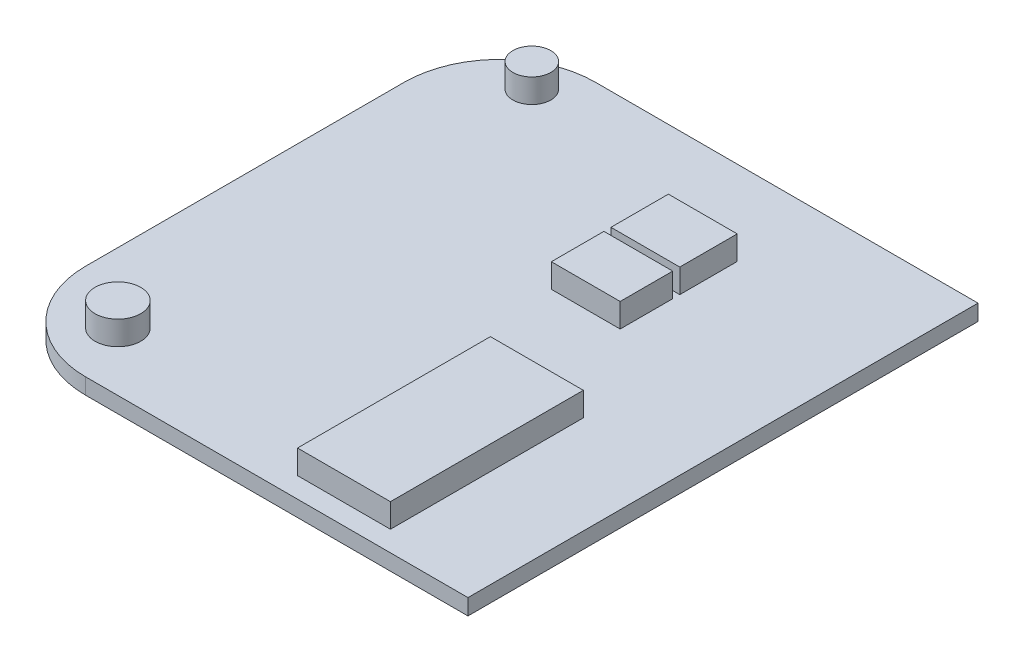
ISO-10303-21;
HEADER;
FILE_DESCRIPTION(('STEP AP214'),'2;1');
FILE_NAME('part.step','',(''),(''),'','','');
FILE_SCHEMA(('AUTOMOTIVE_DESIGN { 1 0 10303 214 1 1 1 1 }'));
ENDSEC;
DATA;
#1=APPLICATION_CONTEXT('core data for automotive mechanical design processes');
#2=APPLICATION_PROTOCOL_DEFINITION('international standard','automotive_design',2000,#1);
#3=PRODUCT_CONTEXT('',#1,'mechanical');
#4=PRODUCT('Part','Part','',(#3));
#5=PRODUCT_RELATED_PRODUCT_CATEGORY('part','',(#4));
#6=PRODUCT_DEFINITION_FORMATION('','',#4);
#7=PRODUCT_DEFINITION_CONTEXT('part definition',#1,'design');
#8=PRODUCT_DEFINITION('design','',#6,#7);
#9=PRODUCT_DEFINITION_SHAPE('','',#8);
#10=(LENGTH_UNIT() NAMED_UNIT(*) SI_UNIT(.MILLI.,.METRE.));
#11=(NAMED_UNIT(*) PLANE_ANGLE_UNIT() SI_UNIT($,.RADIAN.));
#12=(NAMED_UNIT(*) SI_UNIT($,.STERADIAN.) SOLID_ANGLE_UNIT());
#13=UNCERTAINTY_MEASURE_WITH_UNIT(LENGTH_MEASURE(1.E-05),#10,'distance_accuracy_value','');
#14=(GEOMETRIC_REPRESENTATION_CONTEXT(3) GLOBAL_UNCERTAINTY_ASSIGNED_CONTEXT((#13)) GLOBAL_UNIT_ASSIGNED_CONTEXT((#10,
#11,#12)) REPRESENTATION_CONTEXT('',''));
#15=CARTESIAN_POINT('',(0.,0.,0.));
#16=DIRECTION('',(0.,0.,1.));
#17=DIRECTION('',(1.,0.,0.));
#18=AXIS2_PLACEMENT_3D('',#15,#16,#17);
#19=CARTESIAN_POINT('',(-6.99273607748182,1.,10.7360774818402));
#20=DIRECTION('',(0.,1.,0.));
#21=DIRECTION('',(0.,0.,1.));
#22=AXIS2_PLACEMENT_3D('',#19,#20,#21);
#23=PLANE('',#22);
#24=CARTESIAN_POINT('',(-8.61619204420754,1.,-12.8959412146622));
#25=DIRECTION('',(0.,1.,0.));
#26=DIRECTION('',(0.,0.,1.));
#27=AXIS2_PLACEMENT_3D('',#24,#25,#26);
#28=CIRCLE('',#27,1.18982706827328);
#29=CARTESIAN_POINT('',(-8.61619204420754,1.,-11.706114146389));
#30=VERTEX_POINT('',#29);
#31=EDGE_CURVE('E405',#30,#30,#28,.T.);
#32=ORIENTED_EDGE('',*,*,#31,.F.);
#33=EDGE_LOOP('',(#32));
#34=FACE_BOUND('',#33,.T.);
#35=CARTESIAN_POINT('',(-8.61619204420754,1.,13.0762839327888));
#36=DIRECTION('',(0.,1.,0.));
#37=DIRECTION('',(0.,0.,1.));
#38=AXIS2_PLACEMENT_3D('',#35,#36,#37);
#39=CIRCLE('',#38,1.43304396443584);
#40=CARTESIAN_POINT('',(-8.61619204420754,1.,14.5093278972246));
#41=VERTEX_POINT('',#40);
#42=EDGE_CURVE('E404',#41,#41,#39,.T.);
#43=ORIENTED_EDGE('',*,*,#42,.F.);
#44=EDGE_LOOP('',(#43));
#45=FACE_BOUND('',#44,.T.);
#46=DIRECTION('',(0.,0.,-1.));
#47=VECTOR('',#46,1.);
#48=CARTESIAN_POINT('',(17.0072639225182,1.,-15.2639225181598));
#49=LINE('',#48,#47);
#50=CARTESIAN_POINT('',(17.0072639225182,1.,16.7360774818402));
#51=VERTEX_POINT('',#50);
#52=CARTESIAN_POINT('',(17.0072639225182,1.,-15.2639225181598));
#53=VERTEX_POINT('',#52);
#54=EDGE_CURVE('E247',#51,#53,#49,.T.);
#55=ORIENTED_EDGE('',*,*,#54,.T.);
#56=DIRECTION('',(-1.,0.,0.));
#57=VECTOR('',#56,1.);
#58=CARTESIAN_POINT('',(-6.99273607748178,1.,-15.2639225181598));
#59=LINE('',#58,#57);
#60=CARTESIAN_POINT('',(-6.99273607748178,1.,-15.2639225181598));
#61=VERTEX_POINT('',#60);
#62=EDGE_CURVE('E250',#53,#61,#59,.T.);
#63=ORIENTED_EDGE('',*,*,#62,.T.);
#64=CARTESIAN_POINT('',(-6.99273607748182,1.,-9.26392251815981));
#65=DIRECTION('',(0.,1.,0.));
#66=DIRECTION('',(0.,0.,1.));
#67=AXIS2_PLACEMENT_3D('',#64,#65,#66);
#68=CIRCLE('',#67,6.);
#69=CARTESIAN_POINT('',(-12.9927360774818,1.,-9.26392251815977));
#70=VERTEX_POINT('',#69);
#71=EDGE_CURVE('E253',#61,#70,#68,.T.);
#72=ORIENTED_EDGE('',*,*,#71,.T.);
#73=DIRECTION('',(0.,0.,1.));
#74=VECTOR('',#73,1.);
#75=CARTESIAN_POINT('',(-12.9927360774818,1.,-9.26392251815977));
#76=LINE('',#75,#74);
#77=CARTESIAN_POINT('',(-12.9927360774818,1.,10.7360774818401));
#78=VERTEX_POINT('',#77);
#79=EDGE_CURVE('E255',#70,#78,#76,.T.);
#80=ORIENTED_EDGE('',*,*,#79,.T.);
#81=CARTESIAN_POINT('',(-6.99273607748182,1.,10.7360774818402));
#82=DIRECTION('',(0.,1.,0.));
#83=DIRECTION('',(0.,0.,1.));
#84=AXIS2_PLACEMENT_3D('',#81,#82,#83);
#85=CIRCLE('',#84,6.);
#86=CARTESIAN_POINT('',(-6.99273607748178,1.,16.7360774818402));
#87=VERTEX_POINT('',#86);
#88=EDGE_CURVE('E257',#78,#87,#85,.T.);
#89=ORIENTED_EDGE('',*,*,#88,.T.);
#90=DIRECTION('',(1.,0.,0.));
#91=VECTOR('',#90,1.);
#92=CARTESIAN_POINT('',(-6.99273607748178,1.,16.7360774818402));
#93=LINE('',#92,#91);
#94=EDGE_CURVE('E259',#87,#51,#93,.T.);
#95=ORIENTED_EDGE('',*,*,#94,.T.);
#96=EDGE_LOOP('',(#55,#63,#72,#80,#89,#95));
#97=FACE_BOUND('',#96,.T.);
#98=DIRECTION('',(1.,0.,0.));
#99=VECTOR('',#98,1.);
#100=CARTESIAN_POINT('',(2.874137929403,1.,-6.36888986870597));
#101=LINE('',#100,#99);
#102=CARTESIAN_POINT('',(2.874137929403,1.,-6.36888986870597));
#103=VERTEX_POINT('',#102);
#104=CARTESIAN_POINT('',(7.19151043428033,1.,-6.36888986870597));
#105=VERTEX_POINT('',#104);
#106=EDGE_CURVE('E231',#103,#105,#101,.T.);
#107=ORIENTED_EDGE('',*,*,#106,.F.);
#108=DIRECTION('',(0.,0.,1.));
#109=VECTOR('',#108,1.);
#110=CARTESIAN_POINT('',(2.874137929403,1.,-9.97236613261934));
#111=LINE('',#110,#109);
#112=CARTESIAN_POINT('',(2.874137929403,1.,-9.97236613261934));
#113=VERTEX_POINT('',#112);
#114=EDGE_CURVE('E217',#113,#103,#111,.T.);
#115=ORIENTED_EDGE('',*,*,#114,.F.);
#116=DIRECTION('',(-1.,0.,0.));
#117=VECTOR('',#116,1.);
#118=CARTESIAN_POINT('',(2.874137929403,1.,-9.97236613261934));
#119=LINE('',#118,#117);
#120=CARTESIAN_POINT('',(7.19151043428033,1.,-9.97236613261934));
#121=VERTEX_POINT('',#120);
#122=EDGE_CURVE('E222',#121,#113,#119,.T.);
#123=ORIENTED_EDGE('',*,*,#122,.F.);
#124=DIRECTION('',(0.,0.,-1.));
#125=VECTOR('',#124,1.);
#126=CARTESIAN_POINT('',(7.19151043428033,1.,-9.97236613261934));
#127=LINE('',#126,#125);
#128=EDGE_CURVE('E233',#105,#121,#127,.T.);
#129=ORIENTED_EDGE('',*,*,#128,.F.);
#130=EDGE_LOOP('',(#107,#115,#123,#129));
#131=FACE_BOUND('',#130,.T.);
#132=DIRECTION('',(1.,0.,0.));
#133=VECTOR('',#132,1.);
#134=CARTESIAN_POINT('',(2.874137929403,1.,-2.62943336841852));
#135=LINE('',#134,#133);
#136=CARTESIAN_POINT('',(2.874137929403,1.,-2.62943336841852));
#137=VERTEX_POINT('',#136);
#138=CARTESIAN_POINT('',(7.19151043428033,1.,-2.62943336841852));
#139=VERTEX_POINT('',#138);
#140=EDGE_CURVE('E189',#137,#139,#135,.T.);
#141=ORIENTED_EDGE('',*,*,#140,.F.);
#142=DIRECTION('',(0.,0.,1.));
#143=VECTOR('',#142,1.);
#144=CARTESIAN_POINT('',(2.874137929403,1.,-5.92695410049018));
#145=LINE('',#144,#143);
#146=CARTESIAN_POINT('',(2.874137929403,1.,-5.92695410049018));
#147=VERTEX_POINT('',#146);
#148=EDGE_CURVE('E186',#147,#137,#145,.T.);
#149=ORIENTED_EDGE('',*,*,#148,.F.);
#150=DIRECTION('',(-1.,0.,0.));
#151=VECTOR('',#150,1.);
#152=CARTESIAN_POINT('',(2.874137929403,1.,-5.92695410049018));
#153=LINE('',#152,#151);
#154=CARTESIAN_POINT('',(7.19151043428033,1.,-5.92695410049018));
#155=VERTEX_POINT('',#154);
#156=EDGE_CURVE('E198',#155,#147,#153,.T.);
#157=ORIENTED_EDGE('',*,*,#156,.F.);
#158=DIRECTION('',(0.,0.,-1.));
#159=VECTOR('',#158,1.);
#160=CARTESIAN_POINT('',(7.19151043428033,1.,-5.92695410049018));
#161=LINE('',#160,#159);
#162=EDGE_CURVE('E206',#139,#155,#161,.T.);
#163=ORIENTED_EDGE('',*,*,#162,.F.);
#164=EDGE_LOOP('',(#141,#149,#157,#163));
#165=FACE_BOUND('',#164,.T.);
#166=DIRECTION('',(1.,0.,0.));
#167=VECTOR('',#166,1.);
#168=CARTESIAN_POINT('',(5.03282418184167,1.,15.4559380693353));
#169=LINE('',#168,#167);
#170=CARTESIAN_POINT('',(5.03282418184167,1.,15.4559380693353));
#171=VERTEX_POINT('',#170);
#172=CARTESIAN_POINT('',(10.8629768163807,1.,15.4559380693353));
#173=VERTEX_POINT('',#172);
#174=EDGE_CURVE('E419',#171,#173,#169,.T.);
#175=ORIENTED_EDGE('',*,*,#174,.F.);
#176=DIRECTION('',(0.,0.,1.));
#177=VECTOR('',#176,1.);
#178=CARTESIAN_POINT('',(5.03282418184167,1.,3.3536970320414));
#179=LINE('',#178,#177);
#180=CARTESIAN_POINT('',(5.03282418184167,1.,3.3536970320414));
#181=VERTEX_POINT('',#180);
#182=EDGE_CURVE('E184',#181,#171,#179,.T.);
#183=ORIENTED_EDGE('',*,*,#182,.F.);
#184=DIRECTION('',(-1.,0.,0.));
#185=VECTOR('',#184,1.);
#186=CARTESIAN_POINT('',(5.03282418184167,1.,3.3536970320414));
#187=LINE('',#186,#185);
#188=CARTESIAN_POINT('',(10.8629768163807,1.,3.3536970320414));
#189=VERTEX_POINT('',#188);
#190=EDGE_CURVE('E180',#189,#181,#187,.T.);
#191=ORIENTED_EDGE('',*,*,#190,.F.);
#192=DIRECTION('',(0.,0.,-1.));
#193=VECTOR('',#192,1.);
#194=CARTESIAN_POINT('',(10.8629768163807,1.,3.3536970320414));
#195=LINE('',#194,#193);
#196=EDGE_CURVE('E421',#173,#189,#195,.T.);
#197=ORIENTED_EDGE('',*,*,#196,.F.);
#198=EDGE_LOOP('',(#175,#183,#191,#197));
#199=FACE_BOUND('',#198,.T.);
#200=ADVANCED_FACE('F35',(#34,#45,#97,#131,#165,#199),#23,.T.);
#201=CARTESIAN_POINT('',(17.0072639225182,1.,-15.2639225181598));
#202=DIRECTION('',(-1.,0.,0.));
#203=DIRECTION('',(0.,0.,1.));
#204=AXIS2_PLACEMENT_3D('',#201,#202,#203);
#205=PLANE('',#204);
#206=DIRECTION('',(0.,0.,-1.));
#207=VECTOR('',#206,1.);
#208=CARTESIAN_POINT('',(17.0072639225182,0.,-15.2639225181598));
#209=LINE('',#208,#207);
#210=CARTESIAN_POINT('',(17.0072639225182,0.,16.7360774818402));
#211=VERTEX_POINT('',#210);
#212=CARTESIAN_POINT('',(17.0072639225182,0.,-15.2639225181598));
#213=VERTEX_POINT('',#212);
#214=EDGE_CURVE('E246',#211,#213,#209,.T.);
#215=ORIENTED_EDGE('',*,*,#214,.T.);
#216=DIRECTION('',(0.,-1.,0.));
#217=VECTOR('',#216,1.);
#218=CARTESIAN_POINT('',(17.0072639225182,1.,-15.2639225181598));
#219=LINE('',#218,#217);
#220=EDGE_CURVE('E11',#53,#213,#219,.T.);
#221=ORIENTED_EDGE('',*,*,#220,.F.);
#222=ORIENTED_EDGE('',*,*,#54,.F.);
#223=DIRECTION('',(0.,-1.,0.));
#224=VECTOR('',#223,1.);
#225=CARTESIAN_POINT('',(17.0072639225182,1.,16.7360774818402));
#226=LINE('',#225,#224);
#227=EDGE_CURVE('E261',#51,#211,#226,.T.);
#228=ORIENTED_EDGE('',*,*,#227,.T.);
#229=EDGE_LOOP('',(#215,#221,#222,#228));
#230=FACE_BOUND('',#229,.T.);
#231=ADVANCED_FACE('F37',(#230),#205,.F.);
#232=CARTESIAN_POINT('',(-6.99273607748178,1.,-15.2639225181598));
#233=DIRECTION('',(0.,0.,1.));
#234=DIRECTION('',(1.,0.,0.));
#235=AXIS2_PLACEMENT_3D('',#232,#233,#234);
#236=PLANE('',#235);
#237=DIRECTION('',(-1.,0.,0.));
#238=VECTOR('',#237,1.);
#239=CARTESIAN_POINT('',(-6.99273607748178,0.,-15.2639225181598));
#240=LINE('',#239,#238);
#241=CARTESIAN_POINT('',(-6.99273607748178,0.,-15.2639225181598));
#242=VERTEX_POINT('',#241);
#243=EDGE_CURVE('E264',#213,#242,#240,.T.);
#244=ORIENTED_EDGE('',*,*,#243,.T.);
#245=DIRECTION('',(0.,-1.,0.));
#246=VECTOR('',#245,1.);
#247=CARTESIAN_POINT('',(-6.99273607748178,1.,-15.2639225181598));
#248=LINE('',#247,#246);
#249=EDGE_CURVE('E43',#61,#242,#248,.T.);
#250=ORIENTED_EDGE('',*,*,#249,.F.);
#251=ORIENTED_EDGE('',*,*,#62,.F.);
#252=ORIENTED_EDGE('',*,*,#220,.T.);
#253=EDGE_LOOP('',(#244,#250,#251,#252));
#254=FACE_BOUND('',#253,.T.);
#255=ADVANCED_FACE('F311',(#254),#236,.F.);
#256=CARTESIAN_POINT('',(-6.99273607748182,1.,-9.26392251815981));
#257=DIRECTION('',(0.,-1.,0.));
#258=DIRECTION('',(0.,0.,-1.));
#259=AXIS2_PLACEMENT_3D('',#256,#257,#258);
#260=CYLINDRICAL_SURFACE('',#259,6.);
#261=CARTESIAN_POINT('',(-6.99273607748182,0.,-9.26392251815981));
#262=DIRECTION('',(0.,1.,0.));
#263=DIRECTION('',(0.,0.,1.));
#264=AXIS2_PLACEMENT_3D('',#261,#262,#263);
#265=CIRCLE('',#264,6.);
#266=CARTESIAN_POINT('',(-12.9927360774818,0.,-9.26392251815977));
#267=VERTEX_POINT('',#266);
#268=EDGE_CURVE('E266',#242,#267,#265,.T.);
#269=ORIENTED_EDGE('',*,*,#268,.T.);
#270=DIRECTION('',(0.,-1.,0.));
#271=VECTOR('',#270,1.);
#272=CARTESIAN_POINT('',(-12.9927360774818,1.,-9.26392251815977));
#273=LINE('',#272,#271);
#274=EDGE_CURVE('E281',#70,#267,#273,.T.);
#275=ORIENTED_EDGE('',*,*,#274,.F.);
#276=ORIENTED_EDGE('',*,*,#71,.F.);
#277=ORIENTED_EDGE('',*,*,#249,.T.);
#278=EDGE_LOOP('',(#269,#275,#276,#277));
#279=FACE_BOUND('',#278,.T.);
#280=ADVANCED_FACE('F288',(#279),#260,.T.);
#281=CARTESIAN_POINT('',(-12.9927360774818,1.,-9.26392251815977));
#282=DIRECTION('',(1.,0.,0.));
#283=DIRECTION('',(0.,0.,-1.));
#284=AXIS2_PLACEMENT_3D('',#281,#282,#283);
#285=PLANE('',#284);
#286=DIRECTION('',(0.,0.,1.));
#287=VECTOR('',#286,1.);
#288=CARTESIAN_POINT('',(-12.9927360774818,0.,-9.26392251815977));
#289=LINE('',#288,#287);
#290=CARTESIAN_POINT('',(-12.9927360774818,0.,10.7360774818401));
#291=VERTEX_POINT('',#290);
#292=EDGE_CURVE('E268',#267,#291,#289,.T.);
#293=ORIENTED_EDGE('',*,*,#292,.T.);
#294=DIRECTION('',(0.,-1.,0.));
#295=VECTOR('',#294,1.);
#296=CARTESIAN_POINT('',(-12.9927360774818,1.,10.7360774818401));
#297=LINE('',#296,#295);
#298=EDGE_CURVE('E278',#78,#291,#297,.T.);
#299=ORIENTED_EDGE('',*,*,#298,.F.);
#300=ORIENTED_EDGE('',*,*,#79,.F.);
#301=ORIENTED_EDGE('',*,*,#274,.T.);
#302=EDGE_LOOP('',(#293,#299,#300,#301));
#303=FACE_BOUND('',#302,.T.);
#304=ADVANCED_FACE('F299',(#303),#285,.F.);
#305=CARTESIAN_POINT('',(-6.99273607748182,1.,10.7360774818402));
#306=DIRECTION('',(0.,-1.,0.));
#307=DIRECTION('',(0.,0.,-1.));
#308=AXIS2_PLACEMENT_3D('',#305,#306,#307);
#309=CYLINDRICAL_SURFACE('',#308,6.);
#310=CARTESIAN_POINT('',(-6.99273607748182,0.,10.7360774818402));
#311=DIRECTION('',(0.,1.,0.));
#312=DIRECTION('',(0.,0.,1.));
#313=AXIS2_PLACEMENT_3D('',#310,#311,#312);
#314=CIRCLE('',#313,6.);
#315=CARTESIAN_POINT('',(-6.99273607748178,0.,16.7360774818402));
#316=VERTEX_POINT('',#315);
#317=EDGE_CURVE('E270',#291,#316,#314,.T.);
#318=ORIENTED_EDGE('',*,*,#317,.T.);
#319=DIRECTION('',(0.,-1.,0.));
#320=VECTOR('',#319,1.);
#321=CARTESIAN_POINT('',(-6.99273607748178,1.,16.7360774818402));
#322=LINE('',#321,#320);
#323=EDGE_CURVE('E275',#87,#316,#322,.T.);
#324=ORIENTED_EDGE('',*,*,#323,.F.);
#325=ORIENTED_EDGE('',*,*,#88,.F.);
#326=ORIENTED_EDGE('',*,*,#298,.T.);
#327=EDGE_LOOP('',(#318,#324,#325,#326));
#328=FACE_BOUND('',#327,.T.);
#329=ADVANCED_FACE('F303',(#328),#309,.T.);
#330=CARTESIAN_POINT('',(-6.99273607748178,1.,16.7360774818402));
#331=DIRECTION('',(0.,0.,-1.));
#332=DIRECTION('',(-1.,0.,0.));
#333=AXIS2_PLACEMENT_3D('',#330,#331,#332);
#334=PLANE('',#333);
#335=DIRECTION('',(1.,0.,0.));
#336=VECTOR('',#335,1.);
#337=CARTESIAN_POINT('',(-6.99273607748178,0.,16.7360774818402));
#338=LINE('',#337,#336);
#339=EDGE_CURVE('E251',#316,#211,#338,.T.);
#340=ORIENTED_EDGE('',*,*,#339,.T.);
#341=ORIENTED_EDGE('',*,*,#227,.F.);
#342=ORIENTED_EDGE('',*,*,#94,.F.);
#343=ORIENTED_EDGE('',*,*,#323,.T.);
#344=EDGE_LOOP('',(#340,#341,#342,#343));
#345=FACE_BOUND('',#344,.T.);
#346=ADVANCED_FACE('F314',(#345),#334,.F.);
#347=CARTESIAN_POINT('',(-6.99273607748182,0.,10.7360774818402));
#348=DIRECTION('',(0.,1.,0.));
#349=DIRECTION('',(0.,0.,1.));
#350=AXIS2_PLACEMENT_3D('',#347,#348,#349);
#351=PLANE('',#350);
#352=ORIENTED_EDGE('',*,*,#214,.F.);
#353=ORIENTED_EDGE('',*,*,#339,.F.);
#354=ORIENTED_EDGE('',*,*,#317,.F.);
#355=ORIENTED_EDGE('',*,*,#292,.F.);
#356=ORIENTED_EDGE('',*,*,#268,.F.);
#357=ORIENTED_EDGE('',*,*,#243,.F.);
#358=EDGE_LOOP('',(#352,#353,#354,#355,#356,#357));
#359=FACE_BOUND('',#358,.T.);
#360=ADVANCED_FACE('F294',(#359),#351,.F.);
#361=CARTESIAN_POINT('',(2.874137929403,2.5,-9.97236613261934));
#362=DIRECTION('',(1.,0.,0.));
#363=DIRECTION('',(0.,0.,-1.));
#364=AXIS2_PLACEMENT_3D('',#361,#362,#363);
#365=PLANE('',#364);
#366=ORIENTED_EDGE('',*,*,#114,.T.);
#367=DIRECTION('',(0.,-1.,0.));
#368=VECTOR('',#367,1.);
#369=CARTESIAN_POINT('',(2.874137929403,2.5,-6.36888986870597));
#370=LINE('',#369,#368);
#371=CARTESIAN_POINT('',(2.874137929403,2.5,-6.36888986870597));
#372=VERTEX_POINT('',#371);
#373=EDGE_CURVE('E244',#372,#103,#370,.T.);
#374=ORIENTED_EDGE('',*,*,#373,.F.);
#375=DIRECTION('',(0.,0.,1.));
#376=VECTOR('',#375,1.);
#377=CARTESIAN_POINT('',(2.874137929403,2.5,-9.97236613261934));
#378=LINE('',#377,#376);
#379=CARTESIAN_POINT('',(2.874137929403,2.5,-9.97236613261934));
#380=VERTEX_POINT('',#379);
#381=EDGE_CURVE('E218',#380,#372,#378,.T.);
#382=ORIENTED_EDGE('',*,*,#381,.F.);
#383=DIRECTION('',(0.,-1.,0.));
#384=VECTOR('',#383,1.);
#385=CARTESIAN_POINT('',(2.874137929403,2.5,-9.97236613261934));
#386=LINE('',#385,#384);
#387=EDGE_CURVE('E228',#380,#113,#386,.T.);
#388=ORIENTED_EDGE('',*,*,#387,.T.);
#389=EDGE_LOOP('',(#366,#374,#382,#388));
#390=FACE_BOUND('',#389,.T.);
#391=ADVANCED_FACE('F321',(#390),#365,.F.);
#392=CARTESIAN_POINT('',(2.874137929403,2.5,-6.36888986870597));
#393=DIRECTION('',(0.,0.,-1.));
#394=DIRECTION('',(-1.,0.,0.));
#395=AXIS2_PLACEMENT_3D('',#392,#393,#394);
#396=PLANE('',#395);
#397=ORIENTED_EDGE('',*,*,#106,.T.);
#398=DIRECTION('',(0.,-1.,0.));
#399=VECTOR('',#398,1.);
#400=CARTESIAN_POINT('',(7.19151043428033,2.5,-6.36888986870597));
#401=LINE('',#400,#399);
#402=CARTESIAN_POINT('',(7.19151043428033,2.5,-6.36888986870597));
#403=VERTEX_POINT('',#402);
#404=EDGE_CURVE('E241',#403,#105,#401,.T.);
#405=ORIENTED_EDGE('',*,*,#404,.F.);
#406=DIRECTION('',(1.,0.,0.));
#407=VECTOR('',#406,1.);
#408=CARTESIAN_POINT('',(2.874137929403,2.5,-6.36888986870597));
#409=LINE('',#408,#407);
#410=EDGE_CURVE('E221',#372,#403,#409,.T.);
#411=ORIENTED_EDGE('',*,*,#410,.F.);
#412=ORIENTED_EDGE('',*,*,#373,.T.);
#413=EDGE_LOOP('',(#397,#405,#411,#412));
#414=FACE_BOUND('',#413,.T.);
#415=ADVANCED_FACE('F335',(#414),#396,.F.);
#416=CARTESIAN_POINT('',(7.19151043428033,2.5,-9.97236613261934));
#417=DIRECTION('',(-1.,0.,0.));
#418=DIRECTION('',(0.,0.,1.));
#419=AXIS2_PLACEMENT_3D('',#416,#417,#418);
#420=PLANE('',#419);
#421=ORIENTED_EDGE('',*,*,#128,.T.);
#422=DIRECTION('',(0.,-1.,0.));
#423=VECTOR('',#422,1.);
#424=CARTESIAN_POINT('',(7.19151043428033,2.5,-9.97236613261934));
#425=LINE('',#424,#423);
#426=CARTESIAN_POINT('',(7.19151043428033,2.5,-9.97236613261934));
#427=VERTEX_POINT('',#426);
#428=EDGE_CURVE('E239',#427,#121,#425,.T.);
#429=ORIENTED_EDGE('',*,*,#428,.F.);
#430=DIRECTION('',(0.,0.,-1.));
#431=VECTOR('',#430,1.);
#432=CARTESIAN_POINT('',(7.19151043428033,2.5,-9.97236613261934));
#433=LINE('',#432,#431);
#434=EDGE_CURVE('E224',#403,#427,#433,.T.);
#435=ORIENTED_EDGE('',*,*,#434,.F.);
#436=ORIENTED_EDGE('',*,*,#404,.T.);
#437=EDGE_LOOP('',(#421,#429,#435,#436));
#438=FACE_BOUND('',#437,.T.);
#439=ADVANCED_FACE('F339',(#438),#420,.F.);
#440=CARTESIAN_POINT('',(2.874137929403,2.5,-9.97236613261934));
#441=DIRECTION('',(0.,0.,1.));
#442=DIRECTION('',(1.,0.,0.));
#443=AXIS2_PLACEMENT_3D('',#440,#441,#442);
#444=PLANE('',#443);
#445=ORIENTED_EDGE('',*,*,#122,.T.);
#446=ORIENTED_EDGE('',*,*,#387,.F.);
#447=DIRECTION('',(-1.,0.,0.));
#448=VECTOR('',#447,1.);
#449=CARTESIAN_POINT('',(2.874137929403,2.5,-9.97236613261934));
#450=LINE('',#449,#448);
#451=EDGE_CURVE('E226',#427,#380,#450,.T.);
#452=ORIENTED_EDGE('',*,*,#451,.F.);
#453=ORIENTED_EDGE('',*,*,#428,.T.);
#454=EDGE_LOOP('',(#445,#446,#452,#453));
#455=FACE_BOUND('',#454,.T.);
#456=ADVANCED_FACE('F343',(#455),#444,.F.);
#457=CARTESIAN_POINT('',(0.,2.5,0.));
#458=DIRECTION('',(0.,1.,0.));
#459=DIRECTION('',(0.,0.,1.));
#460=AXIS2_PLACEMENT_3D('',#457,#458,#459);
#461=PLANE('',#460);
#462=ORIENTED_EDGE('',*,*,#381,.T.);
#463=ORIENTED_EDGE('',*,*,#410,.T.);
#464=ORIENTED_EDGE('',*,*,#434,.T.);
#465=ORIENTED_EDGE('',*,*,#451,.T.);
#466=EDGE_LOOP('',(#462,#463,#464,#465));
#467=FACE_BOUND('',#466,.T.);
#468=ADVANCED_FACE('F347',(#467),#461,.T.);
#469=CARTESIAN_POINT('',(2.874137929403,2.5,-5.92695410049018));
#470=DIRECTION('',(1.,0.,0.));
#471=DIRECTION('',(0.,0.,-1.));
#472=AXIS2_PLACEMENT_3D('',#469,#470,#471);
#473=PLANE('',#472);
#474=ORIENTED_EDGE('',*,*,#148,.T.);
#475=DIRECTION('',(0.,-1.,0.));
#476=VECTOR('',#475,1.);
#477=CARTESIAN_POINT('',(2.874137929403,2.5,-2.62943336841852));
#478=LINE('',#477,#476);
#479=CARTESIAN_POINT('',(2.874137929403,2.5,-2.62943336841852));
#480=VERTEX_POINT('',#479);
#481=EDGE_CURVE('E215',#480,#137,#478,.T.);
#482=ORIENTED_EDGE('',*,*,#481,.F.);
#483=DIRECTION('',(0.,0.,1.));
#484=VECTOR('',#483,1.);
#485=CARTESIAN_POINT('',(2.874137929403,2.5,-5.92695410049018));
#486=LINE('',#485,#484);
#487=CARTESIAN_POINT('',(2.874137929403,2.5,-5.92695410049018));
#488=VERTEX_POINT('',#487);
#489=EDGE_CURVE('E194',#488,#480,#486,.T.);
#490=ORIENTED_EDGE('',*,*,#489,.F.);
#491=DIRECTION('',(0.,-1.,0.));
#492=VECTOR('',#491,1.);
#493=CARTESIAN_POINT('',(2.874137929403,2.5,-5.92695410049018));
#494=LINE('',#493,#492);
#495=EDGE_CURVE('E203',#488,#147,#494,.T.);
#496=ORIENTED_EDGE('',*,*,#495,.T.);
#497=EDGE_LOOP('',(#474,#482,#490,#496));
#498=FACE_BOUND('',#497,.T.);
#499=ADVANCED_FACE('F351',(#498),#473,.F.);
#500=CARTESIAN_POINT('',(2.874137929403,2.5,-2.62943336841852));
#501=DIRECTION('',(0.,0.,-1.));
#502=DIRECTION('',(-1.,0.,0.));
#503=AXIS2_PLACEMENT_3D('',#500,#501,#502);
#504=PLANE('',#503);
#505=ORIENTED_EDGE('',*,*,#140,.T.);
#506=DIRECTION('',(0.,-1.,0.));
#507=VECTOR('',#506,1.);
#508=CARTESIAN_POINT('',(7.19151043428033,2.5,-2.62943336841852));
#509=LINE('',#508,#507);
#510=CARTESIAN_POINT('',(7.19151043428033,2.5,-2.62943336841852));
#511=VERTEX_POINT('',#510);
#512=EDGE_CURVE('E212',#511,#139,#509,.T.);
#513=ORIENTED_EDGE('',*,*,#512,.F.);
#514=DIRECTION('',(1.,0.,0.));
#515=VECTOR('',#514,1.);
#516=CARTESIAN_POINT('',(2.874137929403,2.5,-2.62943336841852));
#517=LINE('',#516,#515);
#518=EDGE_CURVE('E197',#480,#511,#517,.T.);
#519=ORIENTED_EDGE('',*,*,#518,.F.);
#520=ORIENTED_EDGE('',*,*,#481,.T.);
#521=EDGE_LOOP('',(#505,#513,#519,#520));
#522=FACE_BOUND('',#521,.T.);
#523=ADVANCED_FACE('F355',(#522),#504,.F.);
#524=CARTESIAN_POINT('',(7.19151043428033,2.5,-5.92695410049018));
#525=DIRECTION('',(-1.,0.,0.));
#526=DIRECTION('',(0.,0.,1.));
#527=AXIS2_PLACEMENT_3D('',#524,#525,#526);
#528=PLANE('',#527);
#529=ORIENTED_EDGE('',*,*,#162,.T.);
#530=DIRECTION('',(0.,-1.,0.));
#531=VECTOR('',#530,1.);
#532=CARTESIAN_POINT('',(7.19151043428033,2.5,-5.92695410049018));
#533=LINE('',#532,#531);
#534=CARTESIAN_POINT('',(7.19151043428033,2.5,-5.92695410049018));
#535=VERTEX_POINT('',#534);
#536=EDGE_CURVE('E58',#535,#155,#533,.T.);
#537=ORIENTED_EDGE('',*,*,#536,.F.);
#538=DIRECTION('',(0.,0.,-1.));
#539=VECTOR('',#538,1.);
#540=CARTESIAN_POINT('',(7.19151043428033,2.5,-5.92695410049018));
#541=LINE('',#540,#539);
#542=EDGE_CURVE('E200',#511,#535,#541,.T.);
#543=ORIENTED_EDGE('',*,*,#542,.F.);
#544=ORIENTED_EDGE('',*,*,#512,.T.);
#545=EDGE_LOOP('',(#529,#537,#543,#544));
#546=FACE_BOUND('',#545,.T.);
#547=ADVANCED_FACE('F359',(#546),#528,.F.);
#548=CARTESIAN_POINT('',(2.874137929403,2.5,-5.92695410049018));
#549=DIRECTION('',(0.,0.,1.));
#550=DIRECTION('',(1.,0.,0.));
#551=AXIS2_PLACEMENT_3D('',#548,#549,#550);
#552=PLANE('',#551);
#553=ORIENTED_EDGE('',*,*,#156,.T.);
#554=ORIENTED_EDGE('',*,*,#495,.F.);
#555=DIRECTION('',(-1.,0.,0.));
#556=VECTOR('',#555,1.);
#557=CARTESIAN_POINT('',(2.874137929403,2.5,-5.92695410049018));
#558=LINE('',#557,#556);
#559=EDGE_CURVE('E202',#535,#488,#558,.T.);
#560=ORIENTED_EDGE('',*,*,#559,.F.);
#561=ORIENTED_EDGE('',*,*,#536,.T.);
#562=EDGE_LOOP('',(#553,#554,#560,#561));
#563=FACE_BOUND('',#562,.T.);
#564=ADVANCED_FACE('F363',(#563),#552,.F.);
#565=CARTESIAN_POINT('',(0.,2.5,0.));
#566=DIRECTION('',(0.,1.,0.));
#567=DIRECTION('',(0.,0.,1.));
#568=AXIS2_PLACEMENT_3D('',#565,#566,#567);
#569=PLANE('',#568);
#570=ORIENTED_EDGE('',*,*,#489,.T.);
#571=ORIENTED_EDGE('',*,*,#518,.T.);
#572=ORIENTED_EDGE('',*,*,#542,.T.);
#573=ORIENTED_EDGE('',*,*,#559,.T.);
#574=EDGE_LOOP('',(#570,#571,#572,#573));
#575=FACE_BOUND('',#574,.T.);
#576=ADVANCED_FACE('F367',(#575),#569,.T.);
#577=CARTESIAN_POINT('',(5.03282418184167,2.5,3.3536970320414));
#578=DIRECTION('',(1.,0.,0.));
#579=DIRECTION('',(0.,0.,-1.));
#580=AXIS2_PLACEMENT_3D('',#577,#578,#579);
#581=PLANE('',#580);
#582=ORIENTED_EDGE('',*,*,#182,.T.);
#583=DIRECTION('',(0.,-1.,0.));
#584=VECTOR('',#583,1.);
#585=CARTESIAN_POINT('',(5.03282418184167,2.5,15.4559380693353));
#586=LINE('',#585,#584);
#587=CARTESIAN_POINT('',(5.03282418184167,2.5,15.4559380693353));
#588=VERTEX_POINT('',#587);
#589=EDGE_CURVE('E165',#588,#171,#586,.T.);
#590=ORIENTED_EDGE('',*,*,#589,.F.);
#591=DIRECTION('',(0.,0.,1.));
#592=VECTOR('',#591,1.);
#593=CARTESIAN_POINT('',(5.03282418184167,2.5,3.3536970320414));
#594=LINE('',#593,#592);
#595=CARTESIAN_POINT('',(5.03282418184167,2.5,3.3536970320414));
#596=VERTEX_POINT('',#595);
#597=EDGE_CURVE('E172',#596,#588,#594,.T.);
#598=ORIENTED_EDGE('',*,*,#597,.F.);
#599=DIRECTION('',(0.,-1.,0.));
#600=VECTOR('',#599,1.);
#601=CARTESIAN_POINT('',(5.03282418184167,2.5,3.3536970320414));
#602=LINE('',#601,#600);
#603=EDGE_CURVE('E417',#596,#181,#602,.T.);
#604=ORIENTED_EDGE('',*,*,#603,.T.);
#605=EDGE_LOOP('',(#582,#590,#598,#604));
#606=FACE_BOUND('',#605,.T.);
#607=ADVANCED_FACE('F182',(#606),#581,.F.);
#608=CARTESIAN_POINT('',(5.03282418184167,2.5,15.4559380693353));
#609=DIRECTION('',(0.,0.,-1.));
#610=DIRECTION('',(-1.,0.,0.));
#611=AXIS2_PLACEMENT_3D('',#608,#609,#610);
#612=PLANE('',#611);
#613=ORIENTED_EDGE('',*,*,#174,.T.);
#614=DIRECTION('',(0.,-1.,0.));
#615=VECTOR('',#614,1.);
#616=CARTESIAN_POINT('',(10.8629768163807,2.5,15.4559380693353));
#617=LINE('',#616,#615);
#618=CARTESIAN_POINT('',(10.8629768163807,2.5,15.4559380693353));
#619=VERTEX_POINT('',#618);
#620=EDGE_CURVE('E168',#619,#173,#617,.T.);
#621=ORIENTED_EDGE('',*,*,#620,.F.);
#622=DIRECTION('',(1.,0.,0.));
#623=VECTOR('',#622,1.);
#624=CARTESIAN_POINT('',(5.03282418184167,2.5,15.4559380693353));
#625=LINE('',#624,#623);
#626=EDGE_CURVE('E161',#588,#619,#625,.T.);
#627=ORIENTED_EDGE('',*,*,#626,.F.);
#628=ORIENTED_EDGE('',*,*,#589,.T.);
#629=EDGE_LOOP('',(#613,#621,#627,#628));
#630=FACE_BOUND('',#629,.T.);
#631=ADVANCED_FACE('F163',(#630),#612,.F.);
#632=CARTESIAN_POINT('',(10.8629768163807,2.5,3.3536970320414));
#633=DIRECTION('',(-1.,0.,0.));
#634=DIRECTION('',(0.,0.,1.));
#635=AXIS2_PLACEMENT_3D('',#632,#633,#634);
#636=PLANE('',#635);
#637=ORIENTED_EDGE('',*,*,#196,.T.);
#638=DIRECTION('',(0.,-1.,0.));
#639=VECTOR('',#638,1.);
#640=CARTESIAN_POINT('',(10.8629768163807,2.5,3.3536970320414));
#641=LINE('',#640,#639);
#642=CARTESIAN_POINT('',(10.8629768163807,2.5,3.3536970320414));
#643=VERTEX_POINT('',#642);
#644=EDGE_CURVE('E50',#643,#189,#641,.T.);
#645=ORIENTED_EDGE('',*,*,#644,.F.);
#646=DIRECTION('',(0.,0.,-1.));
#647=VECTOR('',#646,1.);
#648=CARTESIAN_POINT('',(10.8629768163807,2.5,3.3536970320414));
#649=LINE('',#648,#647);
#650=EDGE_CURVE('E171',#619,#643,#649,.T.);
#651=ORIENTED_EDGE('',*,*,#650,.F.);
#652=ORIENTED_EDGE('',*,*,#620,.T.);
#653=EDGE_LOOP('',(#637,#645,#651,#652));
#654=FACE_BOUND('',#653,.T.);
#655=ADVANCED_FACE('F375',(#654),#636,.F.);
#656=CARTESIAN_POINT('',(5.03282418184167,2.5,3.3536970320414));
#657=DIRECTION('',(0.,0.,1.));
#658=DIRECTION('',(1.,0.,0.));
#659=AXIS2_PLACEMENT_3D('',#656,#657,#658);
#660=PLANE('',#659);
#661=ORIENTED_EDGE('',*,*,#190,.T.);
#662=ORIENTED_EDGE('',*,*,#603,.F.);
#663=DIRECTION('',(-1.,0.,0.));
#664=VECTOR('',#663,1.);
#665=CARTESIAN_POINT('',(5.03282418184167,2.5,3.3536970320414));
#666=LINE('',#665,#664);
#667=EDGE_CURVE('E176',#643,#596,#666,.T.);
#668=ORIENTED_EDGE('',*,*,#667,.F.);
#669=ORIENTED_EDGE('',*,*,#644,.T.);
#670=EDGE_LOOP('',(#661,#662,#668,#669));
#671=FACE_BOUND('',#670,.T.);
#672=ADVANCED_FACE('F378',(#671),#660,.F.);
#673=CARTESIAN_POINT('',(0.,2.5,0.));
#674=DIRECTION('',(0.,1.,0.));
#675=DIRECTION('',(0.,0.,1.));
#676=AXIS2_PLACEMENT_3D('',#673,#674,#675);
#677=PLANE('',#676);
#678=ORIENTED_EDGE('',*,*,#597,.T.);
#679=ORIENTED_EDGE('',*,*,#626,.T.);
#680=ORIENTED_EDGE('',*,*,#650,.T.);
#681=ORIENTED_EDGE('',*,*,#667,.T.);
#682=EDGE_LOOP('',(#678,#679,#680,#681));
#683=FACE_BOUND('',#682,.T.);
#684=ADVANCED_FACE('F175',(#683),#677,.T.);
#685=CARTESIAN_POINT('',(-8.61619204420754,2.5,13.0762839327888));
#686=DIRECTION('',(0.,-1.,0.));
#687=DIRECTION('',(0.,0.,-1.));
#688=AXIS2_PLACEMENT_3D('',#685,#686,#687);
#689=CYLINDRICAL_SURFACE('',#688,1.43304396443584);
#690=CARTESIAN_POINT('',(-8.61619204420754,2.5,13.0762839327888));
#691=DIRECTION('',(0.,1.,0.));
#692=DIRECTION('',(0.,0.,1.));
#693=AXIS2_PLACEMENT_3D('',#690,#691,#692);
#694=CIRCLE('',#693,1.43304396443584);
#695=CARTESIAN_POINT('',(-8.61619204420754,2.5,14.5093278972246));
#696=VERTEX_POINT('',#695);
#697=EDGE_CURVE('E408',#696,#696,#694,.T.);
#698=ORIENTED_EDGE('',*,*,#697,.F.);
#699=EDGE_LOOP('',(#698));
#700=FACE_BOUND('',#699,.T.);
#701=ORIENTED_EDGE('',*,*,#42,.T.);
#702=EDGE_LOOP('',(#701));
#703=FACE_BOUND('',#702,.T.);
#704=ADVANCED_FACE('F384',(#700,#703),#689,.T.);
#705=CARTESIAN_POINT('',(-8.61619204420754,2.5,13.0762839327888));
#706=DIRECTION('',(0.,1.,0.));
#707=DIRECTION('',(0.,0.,1.));
#708=AXIS2_PLACEMENT_3D('',#705,#706,#707);
#709=PLANE('',#708);
#710=ORIENTED_EDGE('',*,*,#697,.T.);
#711=EDGE_LOOP('',(#710));
#712=FACE_BOUND('',#711,.T.);
#713=ADVANCED_FACE('F387',(#712),#709,.T.);
#714=CARTESIAN_POINT('',(-8.61619204420754,2.5,-12.8959412146622));
#715=DIRECTION('',(0.,-1.,0.));
#716=DIRECTION('',(0.,0.,-1.));
#717=AXIS2_PLACEMENT_3D('',#714,#715,#716);
#718=CYLINDRICAL_SURFACE('',#717,1.18982706827328);
#719=CARTESIAN_POINT('',(-8.61619204420754,2.5,-12.8959412146622));
#720=DIRECTION('',(0.,1.,0.));
#721=DIRECTION('',(0.,0.,1.));
#722=AXIS2_PLACEMENT_3D('',#719,#720,#721);
#723=CIRCLE('',#722,1.18982706827328);
#724=CARTESIAN_POINT('',(-8.61619204420754,2.5,-11.706114146389));
#725=VERTEX_POINT('',#724);
#726=EDGE_CURVE('E403',#725,#725,#723,.T.);
#727=ORIENTED_EDGE('',*,*,#726,.F.);
#728=EDGE_LOOP('',(#727));
#729=FACE_BOUND('',#728,.T.);
#730=ORIENTED_EDGE('',*,*,#31,.T.);
#731=EDGE_LOOP('',(#730));
#732=FACE_BOUND('',#731,.T.);
#733=ADVANCED_FACE('F391',(#729,#732),#718,.T.);
#734=CARTESIAN_POINT('',(-8.61619204420754,2.5,-12.8959412146622));
#735=DIRECTION('',(0.,1.,0.));
#736=DIRECTION('',(0.,0.,1.));
#737=AXIS2_PLACEMENT_3D('',#734,#735,#736);
#738=PLANE('',#737);
#739=ORIENTED_EDGE('',*,*,#726,.T.);
#740=EDGE_LOOP('',(#739));
#741=FACE_BOUND('',#740,.T.);
#742=ADVANCED_FACE('F395',(#741),#738,.T.);
#743=CLOSED_SHELL('',(#200,#231,#255,#280,#304,#329,#346,#360,#391,#415,#439,#456,#468,#499,
#523,#547,#564,#576,#607,#631,#655,#672,#684,#704,#713,#733,#742));
#744=MANIFOLD_SOLID_BREP('B2',#743);
#745=ADVANCED_BREP_SHAPE_REPRESENTATION('',(#18,#744),#14);
#746=SHAPE_DEFINITION_REPRESENTATION(#9,#745);
ENDSEC;
END-ISO-10303-21;
